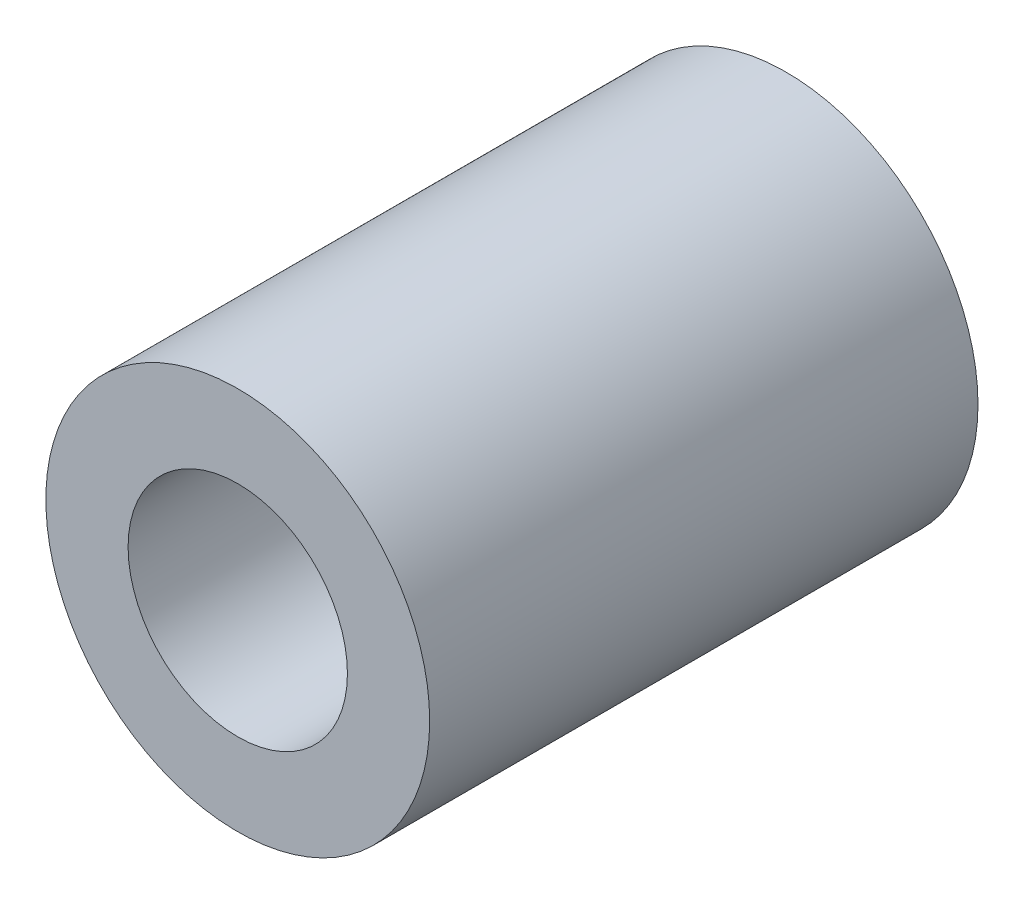
ISO-10303-21;
HEADER;
FILE_DESCRIPTION(('STEP AP214'),'2;1');
FILE_NAME('part.step','',(''),(''),'','','');
FILE_SCHEMA(('AUTOMOTIVE_DESIGN { 1 0 10303 214 1 1 1 1 }'));
ENDSEC;
DATA;
#1=APPLICATION_CONTEXT('core data for automotive mechanical design processes');
#2=APPLICATION_PROTOCOL_DEFINITION('international standard','automotive_design',2000,#1);
#3=PRODUCT_CONTEXT('',#1,'mechanical');
#4=PRODUCT('Part','Part','',(#3));
#5=PRODUCT_RELATED_PRODUCT_CATEGORY('part','',(#4));
#6=PRODUCT_DEFINITION_FORMATION('','',#4);
#7=PRODUCT_DEFINITION_CONTEXT('part definition',#1,'design');
#8=PRODUCT_DEFINITION('design','',#6,#7);
#9=PRODUCT_DEFINITION_SHAPE('','',#8);
#10=(LENGTH_UNIT() NAMED_UNIT(*) SI_UNIT(.MILLI.,.METRE.));
#11=(NAMED_UNIT(*) PLANE_ANGLE_UNIT() SI_UNIT($,.RADIAN.));
#12=(NAMED_UNIT(*) SI_UNIT($,.STERADIAN.) SOLID_ANGLE_UNIT());
#13=UNCERTAINTY_MEASURE_WITH_UNIT(LENGTH_MEASURE(1.E-05),#10,'distance_accuracy_value','');
#14=(GEOMETRIC_REPRESENTATION_CONTEXT(3) GLOBAL_UNCERTAINTY_ASSIGNED_CONTEXT((#13)) GLOBAL_UNIT_ASSIGNED_CONTEXT((#10,
#11,#12)) REPRESENTATION_CONTEXT('',''));
#15=CARTESIAN_POINT('',(0.,0.,0.));
#16=DIRECTION('',(0.,0.,1.));
#17=DIRECTION('',(1.,0.,0.));
#18=AXIS2_PLACEMENT_3D('',#15,#16,#17);
#19=CARTESIAN_POINT('',(0.,0.,30.));
#20=DIRECTION('',(0.,0.,1.));
#21=DIRECTION('',(1.,0.,0.));
#22=AXIS2_PLACEMENT_3D('',#19,#20,#21);
#23=PLANE('',#22);
#24=CARTESIAN_POINT('',(0.,0.,30.));
#25=DIRECTION('',(0.,0.,1.));
#26=DIRECTION('',(1.,0.,0.));
#27=AXIS2_PLACEMENT_3D('',#24,#25,#26);
#28=CIRCLE('',#27,10.5);
#29=CARTESIAN_POINT('',(10.5,0.,30.));
#30=VERTEX_POINT('',#29);
#31=EDGE_CURVE('E10',#30,#30,#28,.T.);
#32=ORIENTED_EDGE('',*,*,#31,.T.);
#33=EDGE_LOOP('',(#32));
#34=FACE_BOUND('',#33,.T.);
#35=CARTESIAN_POINT('',(0.,0.,30.));
#36=DIRECTION('',(0.,0.,1.));
#37=DIRECTION('',(1.,0.,0.));
#38=AXIS2_PLACEMENT_3D('',#35,#36,#37);
#39=CIRCLE('',#38,6.);
#40=CARTESIAN_POINT('',(6.,0.,30.));
#41=VERTEX_POINT('',#40);
#42=EDGE_CURVE('E46',#41,#41,#39,.T.);
#43=ORIENTED_EDGE('',*,*,#42,.F.);
#44=EDGE_LOOP('',(#43));
#45=FACE_BOUND('',#44,.T.);
#46=ADVANCED_FACE('F35',(#34,#45),#23,.T.);
#47=CARTESIAN_POINT('',(0.,0.,0.));
#48=DIRECTION('',(0.,0.,1.));
#49=DIRECTION('',(1.,0.,0.));
#50=AXIS2_PLACEMENT_3D('',#47,#48,#49);
#51=PLANE('',#50);
#52=CARTESIAN_POINT('',(0.,0.,0.));
#53=DIRECTION('',(0.,0.,1.));
#54=DIRECTION('',(1.,0.,0.));
#55=AXIS2_PLACEMENT_3D('',#52,#53,#54);
#56=CIRCLE('',#55,10.5);
#57=CARTESIAN_POINT('',(10.5,0.,0.));
#58=VERTEX_POINT('',#57);
#59=EDGE_CURVE('E39',#58,#58,#56,.T.);
#60=ORIENTED_EDGE('',*,*,#59,.F.);
#61=EDGE_LOOP('',(#60));
#62=FACE_BOUND('',#61,.T.);
#63=CARTESIAN_POINT('',(0.,0.,0.));
#64=DIRECTION('',(0.,0.,1.));
#65=DIRECTION('',(1.,0.,0.));
#66=AXIS2_PLACEMENT_3D('',#63,#64,#65);
#67=CIRCLE('',#66,6.);
#68=CARTESIAN_POINT('',(6.,0.,0.));
#69=VERTEX_POINT('',#68);
#70=EDGE_CURVE('E48',#69,#69,#67,.T.);
#71=ORIENTED_EDGE('',*,*,#70,.T.);
#72=EDGE_LOOP('',(#71));
#73=FACE_BOUND('',#72,.T.);
#74=ADVANCED_FACE('F58',(#62,#73),#51,.F.);
#75=CARTESIAN_POINT('',(0.,0.,30.));
#76=DIRECTION('',(0.,0.,-1.));
#77=DIRECTION('',(-1.,0.,0.));
#78=AXIS2_PLACEMENT_3D('',#75,#76,#77);
#79=CYLINDRICAL_SURFACE('',#78,10.5);
#80=ORIENTED_EDGE('',*,*,#31,.F.);
#81=EDGE_LOOP('',(#80));
#82=FACE_BOUND('',#81,.T.);
#83=ORIENTED_EDGE('',*,*,#59,.T.);
#84=EDGE_LOOP('',(#83));
#85=FACE_BOUND('',#84,.T.);
#86=ADVANCED_FACE('F37',(#82,#85),#79,.T.);
#87=CARTESIAN_POINT('',(0.,0.,30.));
#88=DIRECTION('',(0.,0.,-1.));
#89=DIRECTION('',(-1.,0.,0.));
#90=AXIS2_PLACEMENT_3D('',#87,#88,#89);
#91=CYLINDRICAL_SURFACE('',#90,6.);
#92=ORIENTED_EDGE('',*,*,#42,.T.);
#93=EDGE_LOOP('',(#92));
#94=FACE_BOUND('',#93,.T.);
#95=ORIENTED_EDGE('',*,*,#70,.F.);
#96=EDGE_LOOP('',(#95));
#97=FACE_BOUND('',#96,.T.);
#98=ADVANCED_FACE('F54',(#94,#97),#91,.F.);
#99=CLOSED_SHELL('',(#46,#74,#86,#98));
#100=MANIFOLD_SOLID_BREP('B2',#99);
#101=ADVANCED_BREP_SHAPE_REPRESENTATION('',(#18,#100),#14);
#102=SHAPE_DEFINITION_REPRESENTATION(#9,#101);
ENDSEC;
END-ISO-10303-21;
